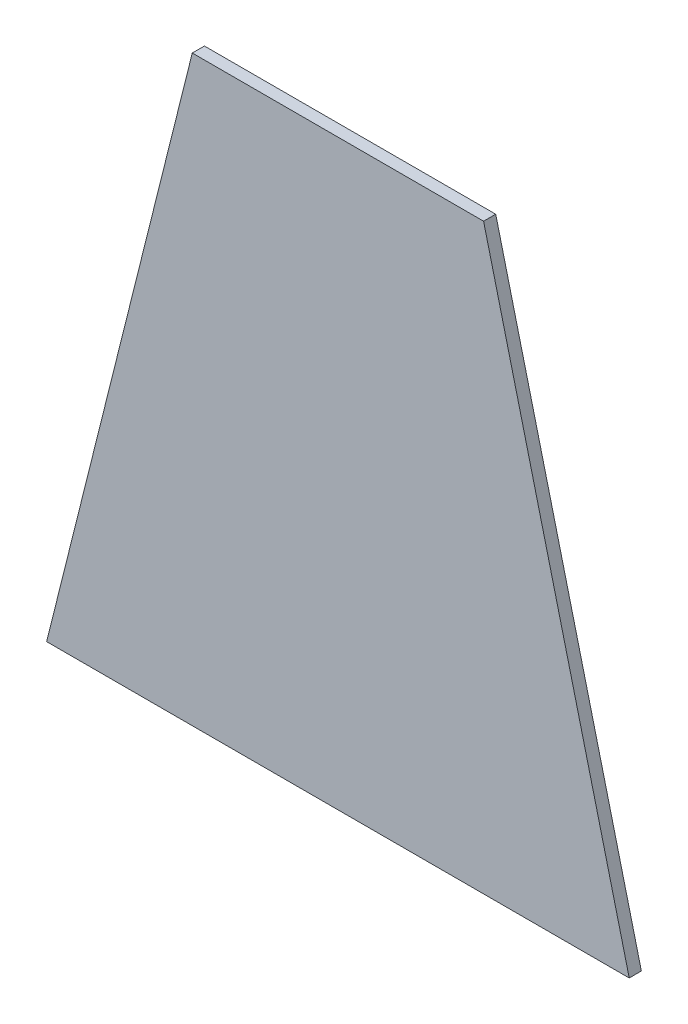
ISO-10303-21;
HEADER;
FILE_DESCRIPTION(('STEP AP214'),'2;1');
FILE_NAME('part.step','',(''),(''),'','','');
FILE_SCHEMA(('AUTOMOTIVE_DESIGN { 1 0 10303 214 1 1 1 1 }'));
ENDSEC;
DATA;
#1=APPLICATION_CONTEXT('core data for automotive mechanical design processes');
#2=APPLICATION_PROTOCOL_DEFINITION('international standard','automotive_design',2000,#1);
#3=PRODUCT_CONTEXT('',#1,'mechanical');
#4=PRODUCT('Part','Part','',(#3));
#5=PRODUCT_RELATED_PRODUCT_CATEGORY('part','',(#4));
#6=PRODUCT_DEFINITION_FORMATION('','',#4);
#7=PRODUCT_DEFINITION_CONTEXT('part definition',#1,'design');
#8=PRODUCT_DEFINITION('design','',#6,#7);
#9=PRODUCT_DEFINITION_SHAPE('','',#8);
#10=(LENGTH_UNIT() NAMED_UNIT(*) SI_UNIT(.MILLI.,.METRE.));
#11=(NAMED_UNIT(*) PLANE_ANGLE_UNIT() SI_UNIT($,.RADIAN.));
#12=(NAMED_UNIT(*) SI_UNIT($,.STERADIAN.) SOLID_ANGLE_UNIT());
#13=UNCERTAINTY_MEASURE_WITH_UNIT(LENGTH_MEASURE(1.E-05),#10,'distance_accuracy_value','');
#14=(GEOMETRIC_REPRESENTATION_CONTEXT(3) GLOBAL_UNCERTAINTY_ASSIGNED_CONTEXT((#13)) GLOBAL_UNIT_ASSIGNED_CONTEXT((#10,
#11,#12)) REPRESENTATION_CONTEXT('',''));
#15=CARTESIAN_POINT('',(0.,0.,0.));
#16=DIRECTION('',(0.,0.,1.));
#17=DIRECTION('',(1.,0.,0.));
#18=AXIS2_PLACEMENT_3D('',#15,#16,#17);
#19=CARTESIAN_POINT('',(38.1,152.4,3.175));
#20=DIRECTION('',(0.970142500145332,-0.242535625036333,0.));
#21=DIRECTION('',(0.242535625036333,0.970142500145332,0.));
#22=AXIS2_PLACEMENT_3D('',#19,#20,#21);
#23=PLANE('',#22);
#24=DIRECTION('',(-0.242535625036333,-0.970142500145332,0.));
#25=VECTOR('',#24,1.);
#26=CARTESIAN_POINT('',(38.1,152.4,0.));
#27=LINE('',#26,#25);
#28=CARTESIAN_POINT('',(38.1,152.4,0.));
#29=VERTEX_POINT('',#28);
#30=CARTESIAN_POINT('',(0.,0.,0.));
#31=VERTEX_POINT('',#30);
#32=EDGE_CURVE('E132',#29,#31,#27,.T.);
#33=ORIENTED_EDGE('',*,*,#32,.T.);
#34=DIRECTION('',(0.,0.,-1.));
#35=VECTOR('',#34,1.);
#36=CARTESIAN_POINT('',(0.,0.,3.175));
#37=LINE('',#36,#35);
#38=CARTESIAN_POINT('',(0.,0.,3.175));
#39=VERTEX_POINT('',#38);
#40=EDGE_CURVE('E12',#39,#31,#37,.T.);
#41=ORIENTED_EDGE('',*,*,#40,.F.);
#42=DIRECTION('',(-0.242535625036333,-0.970142500145332,0.));
#43=VECTOR('',#42,1.);
#44=CARTESIAN_POINT('',(38.1,152.4,3.175));
#45=LINE('',#44,#43);
#46=CARTESIAN_POINT('',(38.1,152.4,3.175));
#47=VERTEX_POINT('',#46);
#48=EDGE_CURVE('E96',#47,#39,#45,.T.);
#49=ORIENTED_EDGE('',*,*,#48,.F.);
#50=DIRECTION('',(0.,0.,-1.));
#51=VECTOR('',#50,1.);
#52=CARTESIAN_POINT('',(38.1,152.4,3.175));
#53=LINE('',#52,#51);
#54=EDGE_CURVE('E108',#47,#29,#53,.T.);
#55=ORIENTED_EDGE('',*,*,#54,.T.);
#56=EDGE_LOOP('',(#33,#41,#49,#55));
#57=FACE_BOUND('',#56,.T.);
#58=ADVANCED_FACE('F44',(#57),#23,.F.);
#59=CARTESIAN_POINT('',(0.,0.,3.175));
#60=DIRECTION('',(0.,1.,0.));
#61=DIRECTION('',(0.,0.,1.));
#62=AXIS2_PLACEMENT_3D('',#59,#60,#61);
#63=PLANE('',#62);
#64=DIRECTION('',(1.,0.,0.));
#65=VECTOR('',#64,1.);
#66=CARTESIAN_POINT('',(0.,0.,0.));
#67=LINE('',#66,#65);
#68=CARTESIAN_POINT('',(152.4,0.,0.));
#69=VERTEX_POINT('',#68);
#70=EDGE_CURVE('E101',#31,#69,#67,.T.);
#71=ORIENTED_EDGE('',*,*,#70,.T.);
#72=DIRECTION('',(0.,0.,-1.));
#73=VECTOR('',#72,1.);
#74=CARTESIAN_POINT('',(152.4,0.,3.175));
#75=LINE('',#74,#73);
#76=CARTESIAN_POINT('',(152.4,0.,3.175));
#77=VERTEX_POINT('',#76);
#78=EDGE_CURVE('E53',#77,#69,#75,.T.);
#79=ORIENTED_EDGE('',*,*,#78,.F.);
#80=DIRECTION('',(1.,0.,0.));
#81=VECTOR('',#80,1.);
#82=CARTESIAN_POINT('',(0.,0.,3.175));
#83=LINE('',#82,#81);
#84=EDGE_CURVE('E91',#39,#77,#83,.T.);
#85=ORIENTED_EDGE('',*,*,#84,.F.);
#86=ORIENTED_EDGE('',*,*,#40,.T.);
#87=EDGE_LOOP('',(#71,#79,#85,#86));
#88=FACE_BOUND('',#87,.T.);
#89=ADVANCED_FACE('F100',(#88),#63,.F.);
#90=CARTESIAN_POINT('',(114.3,152.4,3.175));
#91=DIRECTION('',(-0.970142500145332,-0.242535625036333,0.));
#92=DIRECTION('',(0.242535625036333,-0.970142500145332,0.));
#93=AXIS2_PLACEMENT_3D('',#90,#91,#92);
#94=PLANE('',#93);
#95=DIRECTION('',(-0.242535625036333,0.970142500145332,0.));
#96=VECTOR('',#95,1.);
#97=CARTESIAN_POINT('',(114.3,152.4,0.));
#98=LINE('',#97,#96);
#99=CARTESIAN_POINT('',(114.3,152.4,0.));
#100=VERTEX_POINT('',#99);
#101=EDGE_CURVE('E78',#69,#100,#98,.T.);
#102=ORIENTED_EDGE('',*,*,#101,.T.);
#103=DIRECTION('',(0.,0.,-1.));
#104=VECTOR('',#103,1.);
#105=CARTESIAN_POINT('',(114.3,152.4,3.175));
#106=LINE('',#105,#104);
#107=CARTESIAN_POINT('',(114.3,152.4,3.175));
#108=VERTEX_POINT('',#107);
#109=EDGE_CURVE('E103',#108,#100,#106,.T.);
#110=ORIENTED_EDGE('',*,*,#109,.F.);
#111=DIRECTION('',(-0.242535625036333,0.970142500145332,0.));
#112=VECTOR('',#111,1.);
#113=CARTESIAN_POINT('',(114.3,152.4,3.175));
#114=LINE('',#113,#112);
#115=EDGE_CURVE('E94',#77,#108,#114,.T.);
#116=ORIENTED_EDGE('',*,*,#115,.F.);
#117=ORIENTED_EDGE('',*,*,#78,.T.);
#118=EDGE_LOOP('',(#102,#110,#116,#117));
#119=FACE_BOUND('',#118,.T.);
#120=ADVANCED_FACE('F104',(#119),#94,.F.);
#121=CARTESIAN_POINT('',(38.1,152.4,3.175));
#122=DIRECTION('',(0.,-1.,0.));
#123=DIRECTION('',(1.,0.,0.));
#124=AXIS2_PLACEMENT_3D('',#121,#122,#123);
#125=PLANE('',#124);
#126=DIRECTION('',(-1.,0.,0.));
#127=VECTOR('',#126,1.);
#128=CARTESIAN_POINT('',(38.1,152.4,0.));
#129=LINE('',#128,#127);
#130=EDGE_CURVE('E84',#100,#29,#129,.T.);
#131=ORIENTED_EDGE('',*,*,#130,.T.);
#132=ORIENTED_EDGE('',*,*,#54,.F.);
#133=DIRECTION('',(-1.,0.,0.));
#134=VECTOR('',#133,1.);
#135=CARTESIAN_POINT('',(38.1,152.4,3.175));
#136=LINE('',#135,#134);
#137=EDGE_CURVE('E61',#108,#47,#136,.T.);
#138=ORIENTED_EDGE('',*,*,#137,.F.);
#139=ORIENTED_EDGE('',*,*,#109,.T.);
#140=EDGE_LOOP('',(#131,#132,#138,#139));
#141=FACE_BOUND('',#140,.T.);
#142=ADVANCED_FACE('F127',(#141),#125,.F.);
#143=CARTESIAN_POINT('',(0.,0.,3.175));
#144=DIRECTION('',(0.,0.,1.));
#145=DIRECTION('',(1.,0.,0.));
#146=AXIS2_PLACEMENT_3D('',#143,#144,#145);
#147=PLANE('',#146);
#148=ORIENTED_EDGE('',*,*,#48,.T.);
#149=ORIENTED_EDGE('',*,*,#84,.T.);
#150=ORIENTED_EDGE('',*,*,#115,.T.);
#151=ORIENTED_EDGE('',*,*,#137,.T.);
#152=EDGE_LOOP('',(#148,#149,#150,#151));
#153=FACE_BOUND('',#152,.T.);
#154=ADVANCED_FACE('F92',(#153),#147,.T.);
#155=CARTESIAN_POINT('',(0.,0.,0.));
#156=DIRECTION('',(0.,0.,1.));
#157=DIRECTION('',(1.,0.,0.));
#158=AXIS2_PLACEMENT_3D('',#155,#156,#157);
#159=PLANE('',#158);
#160=ORIENTED_EDGE('',*,*,#32,.F.);
#161=ORIENTED_EDGE('',*,*,#130,.F.);
#162=ORIENTED_EDGE('',*,*,#101,.F.);
#163=ORIENTED_EDGE('',*,*,#70,.F.);
#164=EDGE_LOOP('',(#160,#161,#162,#163));
#165=FACE_BOUND('',#164,.T.);
#166=ADVANCED_FACE('F130',(#165),#159,.F.);
#167=CLOSED_SHELL('',(#58,#89,#120,#142,#154,#166));
#168=MANIFOLD_SOLID_BREP('B2',#167);
#169=ADVANCED_BREP_SHAPE_REPRESENTATION('',(#18,#168),#14);
#170=SHAPE_DEFINITION_REPRESENTATION(#9,#169);
ENDSEC;
END-ISO-10303-21;
